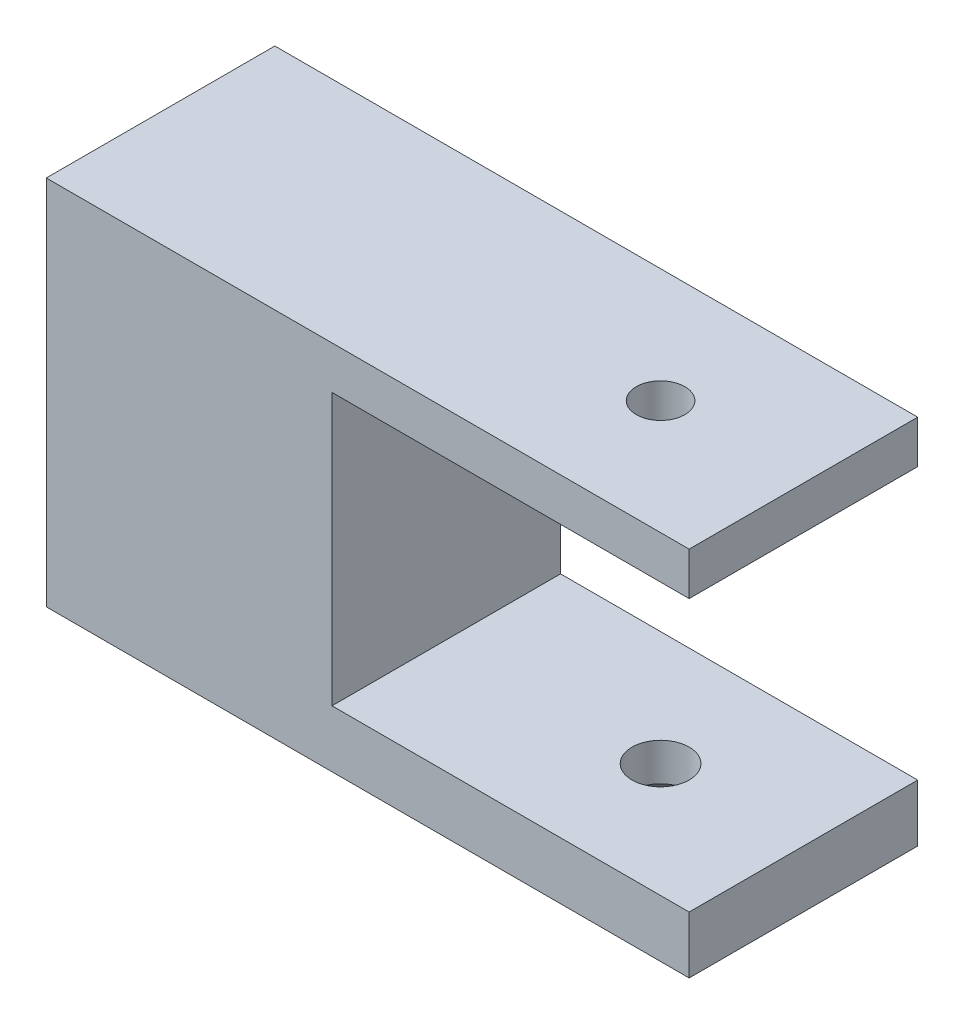
ISO-10303-21;
HEADER;
FILE_DESCRIPTION(('STEP AP214'),'2;1');
FILE_NAME('part.step','',(''),(''),'','','');
FILE_SCHEMA(('AUTOMOTIVE_DESIGN { 1 0 10303 214 1 1 1 1 }'));
ENDSEC;
DATA;
#1=APPLICATION_CONTEXT('core data for automotive mechanical design processes');
#2=APPLICATION_PROTOCOL_DEFINITION('international standard','automotive_design',2000,#1);
#3=PRODUCT_CONTEXT('',#1,'mechanical');
#4=PRODUCT('Part','Part','',(#3));
#5=PRODUCT_RELATED_PRODUCT_CATEGORY('part','',(#4));
#6=PRODUCT_DEFINITION_FORMATION('','',#4);
#7=PRODUCT_DEFINITION_CONTEXT('part definition',#1,'design');
#8=PRODUCT_DEFINITION('design','',#6,#7);
#9=PRODUCT_DEFINITION_SHAPE('','',#8);
#10=(LENGTH_UNIT() NAMED_UNIT(*) SI_UNIT(.MILLI.,.METRE.));
#11=(NAMED_UNIT(*) PLANE_ANGLE_UNIT() SI_UNIT($,.RADIAN.));
#12=(NAMED_UNIT(*) SI_UNIT($,.STERADIAN.) SOLID_ANGLE_UNIT());
#13=UNCERTAINTY_MEASURE_WITH_UNIT(LENGTH_MEASURE(1.E-05),#10,'distance_accuracy_value','');
#14=(GEOMETRIC_REPRESENTATION_CONTEXT(3) GLOBAL_UNCERTAINTY_ASSIGNED_CONTEXT((#13)) GLOBAL_UNIT_ASSIGNED_CONTEXT((#10,
#11,#12)) REPRESENTATION_CONTEXT('',''));
#15=CARTESIAN_POINT('',(0.,0.,0.));
#16=DIRECTION('',(0.,0.,1.));
#17=DIRECTION('',(1.,0.,0.));
#18=AXIS2_PLACEMENT_3D('',#15,#16,#17);
#19=CARTESIAN_POINT('',(-121.785392745691,32.4399830220713,16.));
#20=DIRECTION('',(-1.,0.,0.));
#21=DIRECTION('',(0.,0.,1.));
#22=AXIS2_PLACEMENT_3D('',#19,#20,#21);
#23=PLANE('',#22);
#24=DIRECTION('',(0.,1.,0.));
#25=VECTOR('',#24,1.);
#26=CARTESIAN_POINT('',(-121.785392745691,32.4399830220713,0.));
#27=LINE('',#26,#25);
#28=CARTESIAN_POINT('',(-121.785392745691,29.4399830220713,0.));
#29=VERTEX_POINT('',#28);
#30=CARTESIAN_POINT('',(-121.785392745691,32.4399830220713,0.));
#31=VERTEX_POINT('',#30);
#32=EDGE_CURVE('E140',#29,#31,#27,.T.);
#33=ORIENTED_EDGE('',*,*,#32,.T.);
#34=DIRECTION('',(0.,0.,-1.));
#35=VECTOR('',#34,1.);
#36=CARTESIAN_POINT('',(-121.785392745691,32.4399830220713,16.));
#37=LINE('',#36,#35);
#38=CARTESIAN_POINT('',(-121.785392745691,32.4399830220713,16.));
#39=VERTEX_POINT('',#38);
#40=EDGE_CURVE('E169',#39,#31,#37,.T.);
#41=ORIENTED_EDGE('',*,*,#40,.F.);
#42=DIRECTION('',(0.,1.,0.));
#43=VECTOR('',#42,1.);
#44=CARTESIAN_POINT('',(-121.785392745691,32.4399830220713,16.));
#45=LINE('',#44,#43);
#46=CARTESIAN_POINT('',(-121.785392745691,29.4399830220713,16.));
#47=VERTEX_POINT('',#46);
#48=EDGE_CURVE('E156',#47,#39,#45,.T.);
#49=ORIENTED_EDGE('',*,*,#48,.F.);
#50=DIRECTION('',(0.,0.,-1.));
#51=VECTOR('',#50,1.);
#52=CARTESIAN_POINT('',(-121.785392745691,29.4399830220713,16.));
#53=LINE('',#52,#51);
#54=EDGE_CURVE('E136',#47,#29,#53,.T.);
#55=ORIENTED_EDGE('',*,*,#54,.T.);
#56=EDGE_LOOP('',(#33,#41,#49,#55));
#57=FACE_BOUND('',#56,.T.);
#58=ADVANCED_FACE('F33',(#57),#23,.F.);
#59=CARTESIAN_POINT('',(-166.785392745691,32.4399830220713,16.));
#60=DIRECTION('',(0.,-1.,0.));
#61=DIRECTION('',(0.,0.,-1.));
#62=AXIS2_PLACEMENT_3D('',#59,#60,#61);
#63=PLANE('',#62);
#64=CARTESIAN_POINT('',(-131.785392745691,32.4399830220713,8.));
#65=DIRECTION('',(0.,-1.,0.));
#66=DIRECTION('',(0.,0.,-1.));
#67=AXIS2_PLACEMENT_3D('',#64,#65,#66);
#68=CIRCLE('',#67,1.70000000000001);
#69=CARTESIAN_POINT('',(-131.785392745691,32.4399830220713,6.29999999999999));
#70=VERTEX_POINT('',#69);
#71=EDGE_CURVE('E176',#70,#70,#68,.T.);
#72=ORIENTED_EDGE('',*,*,#71,.T.);
#73=EDGE_LOOP('',(#72));
#74=FACE_BOUND('',#73,.T.);
#75=DIRECTION('',(-1.,0.,0.));
#76=VECTOR('',#75,1.);
#77=CARTESIAN_POINT('',(-166.785392745691,32.4399830220713,0.));
#78=LINE('',#77,#76);
#79=CARTESIAN_POINT('',(-166.785392745691,32.4399830220713,0.));
#80=VERTEX_POINT('',#79);
#81=EDGE_CURVE('E143',#31,#80,#78,.T.);
#82=ORIENTED_EDGE('',*,*,#81,.T.);
#83=DIRECTION('',(0.,0.,-1.));
#84=VECTOR('',#83,1.);
#85=CARTESIAN_POINT('',(-166.785392745691,32.4399830220713,16.));
#86=LINE('',#85,#84);
#87=CARTESIAN_POINT('',(-166.785392745691,32.4399830220713,16.));
#88=VERTEX_POINT('',#87);
#89=EDGE_CURVE('E166',#88,#80,#86,.T.);
#90=ORIENTED_EDGE('',*,*,#89,.F.);
#91=DIRECTION('',(-1.,0.,0.));
#92=VECTOR('',#91,1.);
#93=CARTESIAN_POINT('',(-121.785392745691,32.4399830220713,16.));
#94=LINE('',#93,#92);
#95=EDGE_CURVE('E97',#39,#88,#94,.T.);
#96=ORIENTED_EDGE('',*,*,#95,.F.);
#97=ORIENTED_EDGE('',*,*,#40,.T.);
#98=EDGE_LOOP('',(#82,#90,#96,#97));
#99=FACE_BOUND('',#98,.T.);
#100=ADVANCED_FACE('F231',(#74,#99),#63,.F.);
#101=CARTESIAN_POINT('',(-166.785392745691,6.43998302207129,16.));
#102=DIRECTION('',(1.,0.,0.));
#103=DIRECTION('',(0.,0.,-1.));
#104=AXIS2_PLACEMENT_3D('',#101,#102,#103);
#105=PLANE('',#104);
#106=CARTESIAN_POINT('',(-166.785392745691,19.4399830220713,8.));
#107=DIRECTION('',(-1.,0.,0.));
#108=DIRECTION('',(0.,0.,1.));
#109=AXIS2_PLACEMENT_3D('',#106,#107,#108);
#110=CIRCLE('',#109,6.2);
#111=CARTESIAN_POINT('',(-166.785392745691,19.4399830220713,14.2));
#112=VERTEX_POINT('',#111);
#113=EDGE_CURVE('E202',#112,#112,#110,.T.);
#114=ORIENTED_EDGE('',*,*,#113,.F.);
#115=EDGE_LOOP('',(#114));
#116=FACE_BOUND('',#115,.T.);
#117=DIRECTION('',(0.,-1.,0.));
#118=VECTOR('',#117,1.);
#119=CARTESIAN_POINT('',(-166.785392745691,6.43998302207129,0.));
#120=LINE('',#119,#118);
#121=CARTESIAN_POINT('',(-166.785392745691,6.43998302207129,0.));
#122=VERTEX_POINT('',#121);
#123=EDGE_CURVE('E146',#80,#122,#120,.T.);
#124=ORIENTED_EDGE('',*,*,#123,.T.);
#125=DIRECTION('',(0.,0.,-1.));
#126=VECTOR('',#125,1.);
#127=CARTESIAN_POINT('',(-166.785392745691,6.43998302207129,16.));
#128=LINE('',#127,#126);
#129=CARTESIAN_POINT('',(-166.785392745691,6.43998302207129,16.));
#130=VERTEX_POINT('',#129);
#131=EDGE_CURVE('E163',#130,#122,#128,.T.);
#132=ORIENTED_EDGE('',*,*,#131,.F.);
#133=DIRECTION('',(0.,-1.,0.));
#134=VECTOR('',#133,1.);
#135=CARTESIAN_POINT('',(-166.785392745691,6.43998302207129,16.));
#136=LINE('',#135,#134);
#137=EDGE_CURVE('E211',#88,#130,#136,.T.);
#138=ORIENTED_EDGE('',*,*,#137,.F.);
#139=ORIENTED_EDGE('',*,*,#89,.T.);
#140=EDGE_LOOP('',(#124,#132,#138,#139));
#141=FACE_BOUND('',#140,.T.);
#142=ADVANCED_FACE('F234',(#116,#141),#105,.F.);
#143=CARTESIAN_POINT('',(-121.785392745691,6.4399830220713,16.));
#144=DIRECTION('',(0.,1.,0.));
#145=DIRECTION('',(-1.,0.,0.));
#146=AXIS2_PLACEMENT_3D('',#143,#144,#145);
#147=PLANE('',#146);
#148=CARTESIAN_POINT('',(-131.785392745691,6.43998302207129,8.));
#149=DIRECTION('',(0.,-1.,0.));
#150=DIRECTION('',(0.,0.,-1.));
#151=AXIS2_PLACEMENT_3D('',#148,#149,#150);
#152=CIRCLE('',#151,3.36);
#153=CARTESIAN_POINT('',(-131.785392745691,6.43998302207129,4.64));
#154=VERTEX_POINT('',#153);
#155=EDGE_CURVE('E200',#154,#154,#152,.T.);
#156=ORIENTED_EDGE('',*,*,#155,.F.);
#157=EDGE_LOOP('',(#156));
#158=FACE_BOUND('',#157,.T.);
#159=DIRECTION('',(1.,0.,0.));
#160=VECTOR('',#159,1.);
#161=CARTESIAN_POINT('',(-121.785392745691,6.4399830220713,0.));
#162=LINE('',#161,#160);
#163=CARTESIAN_POINT('',(-121.785392745691,6.4399830220713,0.));
#164=VERTEX_POINT('',#163);
#165=EDGE_CURVE('E148',#122,#164,#162,.T.);
#166=ORIENTED_EDGE('',*,*,#165,.T.);
#167=DIRECTION('',(0.,0.,-1.));
#168=VECTOR('',#167,1.);
#169=CARTESIAN_POINT('',(-121.785392745691,6.4399830220713,16.));
#170=LINE('',#169,#168);
#171=CARTESIAN_POINT('',(-121.785392745691,6.4399830220713,16.));
#172=VERTEX_POINT('',#171);
#173=EDGE_CURVE('E160',#172,#164,#170,.T.);
#174=ORIENTED_EDGE('',*,*,#173,.F.);
#175=DIRECTION('',(1.,0.,0.));
#176=VECTOR('',#175,1.);
#177=CARTESIAN_POINT('',(-121.785392745691,6.4399830220713,16.));
#178=LINE('',#177,#176);
#179=EDGE_CURVE('E213',#130,#172,#178,.T.);
#180=ORIENTED_EDGE('',*,*,#179,.F.);
#181=ORIENTED_EDGE('',*,*,#131,.T.);
#182=EDGE_LOOP('',(#166,#174,#180,#181));
#183=FACE_BOUND('',#182,.T.);
#184=ADVANCED_FACE('F219',(#158,#183),#147,.F.);
#185=CARTESIAN_POINT('',(-121.785392745691,10.4399830220713,16.));
#186=DIRECTION('',(-1.,0.,0.));
#187=DIRECTION('',(0.,0.,1.));
#188=AXIS2_PLACEMENT_3D('',#185,#186,#187);
#189=PLANE('',#188);
#190=DIRECTION('',(0.,1.,0.));
#191=VECTOR('',#190,1.);
#192=CARTESIAN_POINT('',(-121.785392745691,10.4399830220713,0.));
#193=LINE('',#192,#191);
#194=CARTESIAN_POINT('',(-121.785392745691,10.4399830220713,0.));
#195=VERTEX_POINT('',#194);
#196=EDGE_CURVE('E150',#164,#195,#193,.T.);
#197=ORIENTED_EDGE('',*,*,#196,.T.);
#198=DIRECTION('',(0.,0.,-1.));
#199=VECTOR('',#198,1.);
#200=CARTESIAN_POINT('',(-121.785392745691,10.4399830220713,16.));
#201=LINE('',#200,#199);
#202=CARTESIAN_POINT('',(-121.785392745691,10.4399830220713,16.));
#203=VERTEX_POINT('',#202);
#204=EDGE_CURVE('E131',#203,#195,#201,.T.);
#205=ORIENTED_EDGE('',*,*,#204,.F.);
#206=DIRECTION('',(0.,1.,0.));
#207=VECTOR('',#206,1.);
#208=CARTESIAN_POINT('',(-121.785392745691,10.4399830220713,16.));
#209=LINE('',#208,#207);
#210=EDGE_CURVE('E119',#172,#203,#209,.T.);
#211=ORIENTED_EDGE('',*,*,#210,.F.);
#212=ORIENTED_EDGE('',*,*,#173,.T.);
#213=EDGE_LOOP('',(#197,#205,#211,#212));
#214=FACE_BOUND('',#213,.T.);
#215=ADVANCED_FACE('F223',(#214),#189,.F.);
#216=CARTESIAN_POINT('',(-146.785392745691,10.4399830220713,16.));
#217=DIRECTION('',(0.,-1.,0.));
#218=DIRECTION('',(0.,0.,-1.));
#219=AXIS2_PLACEMENT_3D('',#216,#217,#218);
#220=PLANE('',#219);
#221=CARTESIAN_POINT('',(-131.785392745691,10.4399830220713,8.));
#222=DIRECTION('',(0.,-1.,0.));
#223=DIRECTION('',(1.,0.,0.));
#224=AXIS2_PLACEMENT_3D('',#221,#222,#223);
#225=CIRCLE('',#224,2.);
#226=CARTESIAN_POINT('',(-129.785392745691,10.4399830220713,8.));
#227=VERTEX_POINT('',#226);
#228=EDGE_CURVE('E179',#227,#227,#225,.T.);
#229=ORIENTED_EDGE('',*,*,#228,.T.);
#230=EDGE_LOOP('',(#229));
#231=FACE_BOUND('',#230,.T.);
#232=DIRECTION('',(-1.,0.,0.));
#233=VECTOR('',#232,1.);
#234=CARTESIAN_POINT('',(-146.785392745691,10.4399830220713,0.));
#235=LINE('',#234,#233);
#236=CARTESIAN_POINT('',(-146.785392745691,10.4399830220713,0.));
#237=VERTEX_POINT('',#236);
#238=EDGE_CURVE('E128',#195,#237,#235,.T.);
#239=ORIENTED_EDGE('',*,*,#238,.T.);
#240=DIRECTION('',(0.,0.,-1.));
#241=VECTOR('',#240,1.);
#242=CARTESIAN_POINT('',(-146.785392745691,10.4399830220713,16.));
#243=LINE('',#242,#241);
#244=CARTESIAN_POINT('',(-146.785392745691,10.4399830220713,16.));
#245=VERTEX_POINT('',#244);
#246=EDGE_CURVE('E125',#245,#237,#243,.T.);
#247=ORIENTED_EDGE('',*,*,#246,.F.);
#248=DIRECTION('',(-1.,0.,0.));
#249=VECTOR('',#248,1.);
#250=CARTESIAN_POINT('',(-146.785392745691,10.4399830220713,16.));
#251=LINE('',#250,#249);
#252=EDGE_CURVE('E112',#203,#245,#251,.T.);
#253=ORIENTED_EDGE('',*,*,#252,.F.);
#254=ORIENTED_EDGE('',*,*,#204,.T.);
#255=EDGE_LOOP('',(#239,#247,#253,#254));
#256=FACE_BOUND('',#255,.T.);
#257=ADVANCED_FACE('F126',(#231,#256),#220,.F.);
#258=CARTESIAN_POINT('',(-146.785392745691,29.4399830220713,16.));
#259=DIRECTION('',(-1.,0.,0.));
#260=DIRECTION('',(0.,0.,1.));
#261=AXIS2_PLACEMENT_3D('',#258,#259,#260);
#262=PLANE('',#261);
#263=DIRECTION('',(0.,1.,0.));
#264=VECTOR('',#263,1.);
#265=CARTESIAN_POINT('',(-146.785392745691,29.4399830220713,0.));
#266=LINE('',#265,#264);
#267=CARTESIAN_POINT('',(-146.785392745691,29.4399830220713,0.));
#268=VERTEX_POINT('',#267);
#269=EDGE_CURVE('E153',#237,#268,#266,.T.);
#270=ORIENTED_EDGE('',*,*,#269,.T.);
#271=DIRECTION('',(0.,0.,-1.));
#272=VECTOR('',#271,1.);
#273=CARTESIAN_POINT('',(-146.785392745691,29.4399830220713,16.));
#274=LINE('',#273,#272);
#275=CARTESIAN_POINT('',(-146.785392745691,29.4399830220713,16.));
#276=VERTEX_POINT('',#275);
#277=EDGE_CURVE('E132',#276,#268,#274,.T.);
#278=ORIENTED_EDGE('',*,*,#277,.F.);
#279=DIRECTION('',(0.,1.,0.));
#280=VECTOR('',#279,1.);
#281=CARTESIAN_POINT('',(-146.785392745691,29.4399830220713,16.));
#282=LINE('',#281,#280);
#283=EDGE_CURVE('E116',#245,#276,#282,.T.);
#284=ORIENTED_EDGE('',*,*,#283,.F.);
#285=ORIENTED_EDGE('',*,*,#246,.T.);
#286=EDGE_LOOP('',(#270,#278,#284,#285));
#287=FACE_BOUND('',#286,.T.);
#288=ADVANCED_FACE('F134',(#287),#262,.F.);
#289=CARTESIAN_POINT('',(-121.785392745691,29.4399830220713,16.));
#290=DIRECTION('',(0.,1.,0.));
#291=DIRECTION('',(0.,0.,1.));
#292=AXIS2_PLACEMENT_3D('',#289,#290,#291);
#293=PLANE('',#292);
#294=CARTESIAN_POINT('',(-131.785392745691,29.4399830220713,8.));
#295=DIRECTION('',(0.,1.,0.));
#296=DIRECTION('',(0.,0.,1.));
#297=AXIS2_PLACEMENT_3D('',#294,#295,#296);
#298=CIRCLE('',#297,1.70000000000001);
#299=CARTESIAN_POINT('',(-131.785392745691,29.4399830220713,9.70000000000001));
#300=VERTEX_POINT('',#299);
#301=EDGE_CURVE('E175',#300,#300,#298,.T.);
#302=ORIENTED_EDGE('',*,*,#301,.T.);
#303=EDGE_LOOP('',(#302));
#304=FACE_BOUND('',#303,.T.);
#305=DIRECTION('',(1.,0.,0.));
#306=VECTOR('',#305,1.);
#307=CARTESIAN_POINT('',(-121.785392745691,29.4399830220713,0.));
#308=LINE('',#307,#306);
#309=EDGE_CURVE('E88',#268,#29,#308,.T.);
#310=ORIENTED_EDGE('',*,*,#309,.T.);
#311=ORIENTED_EDGE('',*,*,#54,.F.);
#312=DIRECTION('',(1.,0.,0.));
#313=VECTOR('',#312,1.);
#314=CARTESIAN_POINT('',(-121.785392745691,29.4399830220713,16.));
#315=LINE('',#314,#313);
#316=EDGE_CURVE('E55',#276,#47,#315,.T.);
#317=ORIENTED_EDGE('',*,*,#316,.F.);
#318=ORIENTED_EDGE('',*,*,#277,.T.);
#319=EDGE_LOOP('',(#310,#311,#317,#318));
#320=FACE_BOUND('',#319,.T.);
#321=ADVANCED_FACE('F227',(#304,#320),#293,.F.);
#322=CARTESIAN_POINT('',(0.,0.,16.));
#323=DIRECTION('',(0.,0.,-1.));
#324=DIRECTION('',(-1.,0.,0.));
#325=AXIS2_PLACEMENT_3D('',#322,#323,#324);
#326=PLANE('',#325);
#327=ORIENTED_EDGE('',*,*,#48,.T.);
#328=ORIENTED_EDGE('',*,*,#95,.T.);
#329=ORIENTED_EDGE('',*,*,#137,.T.);
#330=ORIENTED_EDGE('',*,*,#179,.T.);
#331=ORIENTED_EDGE('',*,*,#210,.T.);
#332=ORIENTED_EDGE('',*,*,#252,.T.);
#333=ORIENTED_EDGE('',*,*,#283,.T.);
#334=ORIENTED_EDGE('',*,*,#316,.T.);
#335=EDGE_LOOP('',(#327,#328,#329,#330,#331,#332,#333,#334));
#336=FACE_BOUND('',#335,.T.);
#337=ADVANCED_FACE('F114',(#336),#326,.F.);
#338=CARTESIAN_POINT('',(0.,0.,0.));
#339=DIRECTION('',(0.,0.,-1.));
#340=DIRECTION('',(-1.,0.,0.));
#341=AXIS2_PLACEMENT_3D('',#338,#339,#340);
#342=PLANE('',#341);
#343=CARTESIAN_POINT('',(-152.785392745691,19.4399830220713,0.));
#344=DIRECTION('',(0.,0.,-1.));
#345=DIRECTION('',(-1.,0.,0.));
#346=AXIS2_PLACEMENT_3D('',#343,#344,#345);
#347=CIRCLE('',#346,3.49999999999999);
#348=CARTESIAN_POINT('',(-156.285392745691,19.4399830220713,0.));
#349=VERTEX_POINT('',#348);
#350=EDGE_CURVE('E362',#349,#349,#347,.T.);
#351=ORIENTED_EDGE('',*,*,#350,.F.);
#352=EDGE_LOOP('',(#351));
#353=FACE_BOUND('',#352,.T.);
#354=ORIENTED_EDGE('',*,*,#32,.F.);
#355=ORIENTED_EDGE('',*,*,#309,.F.);
#356=ORIENTED_EDGE('',*,*,#269,.F.);
#357=ORIENTED_EDGE('',*,*,#238,.F.);
#358=ORIENTED_EDGE('',*,*,#196,.F.);
#359=ORIENTED_EDGE('',*,*,#165,.F.);
#360=ORIENTED_EDGE('',*,*,#123,.F.);
#361=ORIENTED_EDGE('',*,*,#81,.F.);
#362=EDGE_LOOP('',(#354,#355,#356,#357,#358,#359,#360,#361));
#363=FACE_BOUND('',#362,.T.);
#364=ADVANCED_FACE('F226',(#353,#363),#342,.T.);
#365=CARTESIAN_POINT('',(-149.785392745691,19.4399830220713,8.));
#366=DIRECTION('',(-1.,0.,0.));
#367=DIRECTION('',(0.,0.,1.));
#368=AXIS2_PLACEMENT_3D('',#365,#366,#367);
#369=CYLINDRICAL_SURFACE('',#368,6.2);
#370=CARTESIAN_POINT('',(-149.785392745691,19.4399830220713,8.));
#371=DIRECTION('',(-1.,0.,0.));
#372=DIRECTION('',(0.,0.,1.));
#373=AXIS2_PLACEMENT_3D('',#370,#371,#372);
#374=CIRCLE('',#373,6.2);
#375=CARTESIAN_POINT('',(-149.785392745691,17.6372073843393,2.06788402001445));
#376=VERTEX_POINT('',#375);
#377=CARTESIAN_POINT('',(-149.785392745691,21.2427586598033,2.06788402001445));
#378=VERTEX_POINT('',#377);
#379=EDGE_CURVE('E144',#376,#378,#374,.T.);
#380=ORIENTED_EDGE('',*,*,#379,.F.);
#381=CARTESIAN_POINT('',(-149.785392745691,17.6372073843393,2.06788402001445));
#382=CARTESIAN_POINT('',(-149.8381893203,17.5493510485773,2.09457418184887));
#383=CARTESIAN_POINT('',(-149.894646073654,17.4641401788941,2.12261103992937));
#384=CARTESIAN_POINT('',(-150.014413358026,17.2994126175649,2.18058845752548));
#385=CARTESIAN_POINT('',(-150.077721570529,17.2198940147117,2.21052837164569));
#386=CARTESIAN_POINT('',(-150.211004163949,17.0666152861882,2.27165259515535));
#387=CARTESIAN_POINT('',(-150.281002028159,16.9928772334427,2.30284104691949));
#388=CARTESIAN_POINT('',(-150.427050340892,16.8518304675497,2.36551417310408));
#389=CARTESIAN_POINT('',(-150.503101339181,16.7845223396126,2.39699887420132));
#390=CARTESIAN_POINT('',(-150.739743223298,16.5927901105561,2.49058506639717));
#391=CARTESIAN_POINT('',(-150.908982655501,16.478374910113,2.55189512708249));
#392=CARTESIAN_POINT('',(-151.267048898071,16.279855590331,2.66458255219965));
#393=CARTESIAN_POINT('',(-151.45583485487,16.1956898314485,2.71598001537695));
#394=CARTESIAN_POINT('',(-151.809603865211,16.0746538574353,2.79244540699385));
#395=CARTESIAN_POINT('',(-151.971798919014,16.0316919175508,2.82072302471799));
#396=CARTESIAN_POINT('',(-152.302490208652,15.9693863315022,2.86225693002618));
#397=CARTESIAN_POINT('',(-152.470979987917,15.9500191341795,2.87552819529048));
#398=CARTESIAN_POINT('',(-152.809884778442,15.935953337043,2.885133253635));
#399=CARTESIAN_POINT('',(-152.98030335809,15.9413122618532,2.88142755041995));
#400=CARTESIAN_POINT('',(-153.317443701441,15.9765041924066,2.85755529453705));
#401=CARTESIAN_POINT('',(-153.484163376448,16.0063506818111,2.83737967301923));
#402=CARTESIAN_POINT('',(-153.805167777946,16.0878495320962,2.78411435617786));
#403=CARTESIAN_POINT('',(-153.959663046587,16.1389151608516,2.75137382831322));
#404=CARTESIAN_POINT('',(-154.258188768705,16.2608471904667,2.67663676068058));
#405=CARTESIAN_POINT('',(-154.40221541681,16.3317207466519,2.63463687726515));
#406=CARTESIAN_POINT('',(-154.698035105063,16.5031307888828,2.53869427246756));
#407=CARTESIAN_POINT('',(-154.847924486569,16.6064787184149,2.48390289855704));
#408=CARTESIAN_POINT('',(-155.129623135847,16.834696318073,2.37250914807443));
#409=CARTESIAN_POINT('',(-155.261417151754,16.9595839455684,2.31590529278374));
#410=CARTESIAN_POINT('',(-155.520239895299,17.2462700465356,2.19875665867357));
#411=CARTESIAN_POINT('',(-155.644548628499,17.4107403937311,2.13862137229826));
#412=CARTESIAN_POINT('',(-155.808716484433,17.6735673576016,2.056240969624));
#413=CARTESIAN_POINT('',(-155.859742330176,17.7639104194408,2.03007392756657));
#414=CARTESIAN_POINT('',(-155.953861674428,17.9494774980673,1.98106528431758));
#415=CARTESIAN_POINT('',(-155.996959731158,18.0446986695769,1.9582217737929));
#416=CARTESIAN_POINT('',(-156.072760086108,18.2345214273789,1.91758157191007));
#417=CARTESIAN_POINT('',(-156.105873467622,18.3289173396188,1.89959008397183));
#418=CARTESIAN_POINT('',(-156.164023241543,18.5208002225276,1.86774499339738));
#419=CARTESIAN_POINT('',(-156.189063931356,18.6182855181402,1.85388918946929));
#420=CARTESIAN_POINT('',(-156.230706606808,18.8155118494187,1.83073033752543));
#421=CARTESIAN_POINT('',(-156.24731394549,18.9152514120899,1.82142440163556));
#422=CARTESIAN_POINT('',(-156.271844496167,19.1161197081927,1.80764650405669));
#423=CARTESIAN_POINT('',(-156.279768798084,19.2172482656592,1.80317393566882));
#424=CARTESIAN_POINT('',(-156.286370356153,19.4074097120222,1.79944843131047));
#425=CARTESIAN_POINT('',(-156.286066575144,19.4963978271631,1.79962032022083));
#426=CARTESIAN_POINT('',(-156.278689916928,19.6740327451719,1.80378214826332));
#427=CARTESIAN_POINT('',(-156.271614912755,19.762679432006,1.807773287092));
#428=CARTESIAN_POINT('',(-156.250785791092,19.9388984075605,1.81947624811055));
#429=CARTESIAN_POINT('',(-156.237034583841,20.0264711473899,1.82718644910615));
#430=CARTESIAN_POINT('',(-156.203031091044,20.1999679825014,1.84613475069187));
#431=CARTESIAN_POINT('',(-156.182776309474,20.285891431358,1.85737420574707));
#432=CARTESIAN_POINT('',(-156.113755860515,20.5360434087231,1.89536937722083));
#433=CARTESIAN_POINT('',(-156.05617013753,20.6972408615994,1.92673051437327));
#434=CARTESIAN_POINT('',(-155.919309933033,21.0075946275004,1.99932594336065));
#435=CARTESIAN_POINT('',(-155.840030850537,21.1567483774535,2.04056232942311));
#436=CARTESIAN_POINT('',(-155.653646091438,21.4541161590576,2.13401640727023));
#437=CARTESIAN_POINT('',(-155.544622465379,21.6009177307525,2.18690266564541));
#438=CARTESIAN_POINT('',(-155.305883453015,21.875193689761,2.29635092721798));
#439=CARTESIAN_POINT('',(-155.176146474256,22.0026476348225,2.3529167292548));
#440=CARTESIAN_POINT('',(-154.8821723614,22.249699902315,2.4713177865065));
#441=CARTESIAN_POINT('',(-154.71568274248,22.3667033304913,2.53300971266139));
#442=CARTESIAN_POINT('',(-154.362641460224,22.5710818235009,2.64743264506014));
#443=CARTESIAN_POINT('',(-154.176109719801,22.6584859591354,2.70017241807023));
#444=CARTESIAN_POINT('',(-153.824599485556,22.7863159888787,2.78017088194965));
#445=CARTESIAN_POINT('',(-153.66241316411,22.832553970885,2.81038330624612));
#446=CARTESIAN_POINT('',(-153.331129913734,22.9012986354667,2.85597073061453));
#447=CARTESIAN_POINT('',(-153.162041324994,22.9238331265185,2.87136311546976));
#448=CARTESIAN_POINT('',(-152.821161210513,22.9439732402196,2.88509805526773));
#449=CARTESIAN_POINT('',(-152.649363194556,22.9415053021562,2.88339029932846));
#450=CARTESIAN_POINT('',(-152.308953401395,22.9116151123764,2.86306796604682));
#451=CARTESIAN_POINT('',(-152.140343036551,22.884182052111,2.84444606580052));
#452=CARTESIAN_POINT('',(-151.817091152689,22.8073280796071,2.79394818423317));
#453=CARTESIAN_POINT('',(-151.662164185099,22.7587494483769,2.76258272098713));
#454=CARTESIAN_POINT('',(-151.362399886347,22.6417040405417,2.69022601842818));
#455=CARTESIAN_POINT('',(-151.217569163926,22.5732243860242,2.64922854956477));
#456=CARTESIAN_POINT('',(-150.920568696786,22.4073502104409,2.55527586416732));
#457=CARTESIAN_POINT('',(-150.770185766964,22.3072570265905,2.50145048831189));
#458=CARTESIAN_POINT('',(-150.487094476263,22.0857546815752,2.39150996281129));
#459=CARTESIAN_POINT('',(-150.354379607218,21.9643534078253,2.3353956663136));
#460=CARTESIAN_POINT('',(-150.14738640067,21.7434736147761,2.24296875536751));
#461=CARTESIAN_POINT('',(-150.067868410135,21.6491337818365,2.20598607123998));
#462=CARTESIAN_POINT('',(-149.918920449132,21.4520858298735,2.13463923561153));
#463=CARTESIAN_POINT('',(-149.849478842116,21.3493875809445,2.10027208577779));
#464=CARTESIAN_POINT('',(-149.785392745691,21.2427586598033,2.06788402001445));
#465=B_SPLINE_CURVE_WITH_KNOTS('',3,(#381,#382,#383,#384,#385,#386,#387,#388,#389,#390,#391,
#392,#393,#394,#395,#396,#397,#398,#399,#400,#401,#402,#403,#404,#405,#406,#407,#408,#409,#410,
#411,#412,#413,#414,#415,#416,#417,#418,#419,#420,#421,#422,#423,#424,#425,#426,#427,#428,#429,
#430,#431,#432,#433,#434,#435,#436,#437,#438,#439,#440,#441,#442,#443,#444,#445,#446,#447,#448,
#449,#450,#451,#452,#453,#454,#455,#456,#457,#458,#459,#460,#461,#462,#463,#464),.UNSPECIFIED.,
.F.,.F.,(4,2,2,2,2,2,2,2,2,2,2,2,2,2,2,2,2,2,2,2,2,2,2,2,2,2,2,2,2,2,2,2,2,2,2,2,2,2,2,2,2,4),
(0.,0.317603465736774,0.635099789433216,0.953754729111194,1.27243864312916,1.90905137001857,
2.54435941078576,3.05264096134539,3.56041475247611,4.06937045983748,4.57860660324638,
5.07461125706697,5.57079531745091,6.13894977864477,6.70758021292551,7.34826443092954,
7.66891402543124,7.98937867658786,8.29387056218432,8.59820008631687,8.9023361960503,
9.20643412526583,9.47306703290313,9.73978372233613,10.0063842509425,10.2730872214123,
10.7927649489082,11.3125529813364,11.8813122378584,12.4506683109834,13.0855909515073,
13.7198881849586,14.2317179331575,14.7429465406072,15.2556796913219,15.7686349334517,
16.2627993961446,16.7572843464305,17.3206326884053,17.8837729391254,18.2695414282796,
18.6548608115409),.UNSPECIFIED.);
#466=EDGE_CURVE('E190',#376,#378,#465,.T.);
#467=ORIENTED_EDGE('',*,*,#466,.T.);
#468=EDGE_LOOP('',(#380,#467));
#469=FACE_BOUND('',#468,.T.);
#470=ORIENTED_EDGE('',*,*,#113,.T.);
#471=EDGE_LOOP('',(#470));
#472=FACE_BOUND('',#471,.T.);
#473=ADVANCED_FACE('F198',(#469,#472),#369,.F.);
#474=CARTESIAN_POINT('',(-149.785392745691,19.4399830220713,8.));
#475=DIRECTION('',(-1.,0.,0.));
#476=DIRECTION('',(0.,0.,1.));
#477=AXIS2_PLACEMENT_3D('',#474,#475,#476);
#478=PLANE('',#477);
#479=DIRECTION('',(0.,0.,-1.));
#480=VECTOR('',#479,1.);
#481=CARTESIAN_POINT('',(-149.785392745691,21.2427586598033,10.));
#482=LINE('',#481,#480);
#483=CARTESIAN_POINT('',(-149.785392745691,21.2427586598033,10.));
#484=VERTEX_POINT('',#483);
#485=EDGE_CURVE('E11',#484,#378,#482,.T.);
#486=ORIENTED_EDGE('',*,*,#485,.F.);
#487=DIRECTION('',(0.,-1.,0.));
#488=VECTOR('',#487,1.);
#489=CARTESIAN_POINT('',(-149.785392745691,19.4399830220713,10.));
#490=LINE('',#489,#488);
#491=CARTESIAN_POINT('',(-149.785392745691,17.6372073843393,10.));
#492=VERTEX_POINT('',#491);
#493=EDGE_CURVE('E171',#484,#492,#490,.T.);
#494=ORIENTED_EDGE('',*,*,#493,.T.);
#495=DIRECTION('',(0.,0.,-1.));
#496=VECTOR('',#495,1.);
#497=CARTESIAN_POINT('',(-149.785392745691,17.6372073843393,10.));
#498=LINE('',#497,#496);
#499=EDGE_CURVE('E40',#376,#492,#498,.F.);
#500=ORIENTED_EDGE('',*,*,#499,.F.);
#501=ORIENTED_EDGE('',*,*,#379,.T.);
#502=EDGE_LOOP('',(#486,#494,#500,#501));
#503=FACE_BOUND('',#502,.T.);
#504=ADVANCED_FACE('F194',(#503),#478,.T.);
#505=CARTESIAN_POINT('',(-131.785392745691,10.4399830220713,8.));
#506=DIRECTION('',(0.,-1.,0.));
#507=DIRECTION('',(1.,0.,0.));
#508=AXIS2_PLACEMENT_3D('',#505,#506,#507);
#509=CYLINDRICAL_SURFACE('',#508,2.);
#510=CARTESIAN_POINT('',(-131.785392745691,7.7999830220713,8.));
#511=DIRECTION('',(0.,-1.,0.));
#512=DIRECTION('',(0.,0.,-1.));
#513=AXIS2_PLACEMENT_3D('',#510,#511,#512);
#514=CIRCLE('',#513,2.);
#515=CARTESIAN_POINT('',(-131.785392745691,7.7999830220713,6.));
#516=VERTEX_POINT('',#515);
#517=EDGE_CURVE('E172',#516,#516,#514,.T.);
#518=ORIENTED_EDGE('',*,*,#517,.T.);
#519=EDGE_LOOP('',(#518));
#520=FACE_BOUND('',#519,.T.);
#521=ORIENTED_EDGE('',*,*,#228,.F.);
#522=EDGE_LOOP('',(#521));
#523=FACE_BOUND('',#522,.T.);
#524=ADVANCED_FACE('F286',(#520,#523),#509,.F.);
#525=CARTESIAN_POINT('',(-131.785392745691,6.43998302207129,8.));
#526=DIRECTION('',(0.,-1.,0.));
#527=DIRECTION('',(0.,0.,-1.));
#528=AXIS2_PLACEMENT_3D('',#525,#526,#527);
#529=CONICAL_SURFACE('',#528,3.36,0.785398163397447);
#530=ORIENTED_EDGE('',*,*,#155,.T.);
#531=EDGE_LOOP('',(#530));
#532=FACE_BOUND('',#531,.T.);
#533=ORIENTED_EDGE('',*,*,#517,.F.);
#534=EDGE_LOOP('',(#533));
#535=FACE_BOUND('',#534,.T.);
#536=ADVANCED_FACE('F291',(#532,#535),#529,.F.);
#537=CARTESIAN_POINT('',(-131.785392745691,6.43998302207129,8.));
#538=DIRECTION('',(0.,-1.,0.));
#539=DIRECTION('',(0.,0.,-1.));
#540=AXIS2_PLACEMENT_3D('',#537,#538,#539);
#541=CYLINDRICAL_SURFACE('',#540,1.70000000000001);
#542=ORIENTED_EDGE('',*,*,#71,.F.);
#543=EDGE_LOOP('',(#542));
#544=FACE_BOUND('',#543,.T.);
#545=ORIENTED_EDGE('',*,*,#301,.F.);
#546=EDGE_LOOP('',(#545));
#547=FACE_BOUND('',#546,.T.);
#548=ADVANCED_FACE('F303',(#544,#547),#541,.F.);
#549=CARTESIAN_POINT('',(-152.785392745691,19.4399830220713,10.));
#550=DIRECTION('',(0.,0.,-1.));
#551=DIRECTION('',(-1.,0.,0.));
#552=AXIS2_PLACEMENT_3D('',#549,#550,#551);
#553=CYLINDRICAL_SURFACE('',#552,3.49999999999999);
#554=ORIENTED_EDGE('',*,*,#485,.T.);
#555=ORIENTED_EDGE('',*,*,#466,.F.);
#556=ORIENTED_EDGE('',*,*,#499,.T.);
#557=CARTESIAN_POINT('',(-152.785392745691,19.4399830220713,10.));
#558=DIRECTION('',(0.,0.,-1.));
#559=DIRECTION('',(-1.,0.,0.));
#560=AXIS2_PLACEMENT_3D('',#557,#558,#559);
#561=CIRCLE('',#560,3.49999999999999);
#562=EDGE_CURVE('E46',#484,#492,#561,.T.);
#563=ORIENTED_EDGE('',*,*,#562,.F.);
#564=EDGE_LOOP('',(#554,#555,#556,#563));
#565=FACE_BOUND('',#564,.T.);
#566=ORIENTED_EDGE('',*,*,#350,.T.);
#567=EDGE_LOOP('',(#566));
#568=FACE_BOUND('',#567,.T.);
#569=ADVANCED_FACE('F184',(#565,#568),#553,.F.);
#570=CARTESIAN_POINT('',(-152.785392745691,19.4399830220713,10.));
#571=DIRECTION('',(0.,0.,-1.));
#572=DIRECTION('',(-1.,0.,0.));
#573=AXIS2_PLACEMENT_3D('',#570,#571,#572);
#574=PLANE('',#573);
#575=ORIENTED_EDGE('',*,*,#562,.T.);
#576=ORIENTED_EDGE('',*,*,#493,.F.);
#577=EDGE_LOOP('',(#575,#576));
#578=FACE_BOUND('',#577,.T.);
#579=ADVANCED_FACE('F195',(#578),#574,.T.);
#580=CLOSED_SHELL('',(#58,#100,#142,#184,#215,#257,#288,#321,#337,#364,#473,#504,#524,#536,#548,
#569,#579));
#581=MANIFOLD_SOLID_BREP('B2',#580);
#582=ADVANCED_BREP_SHAPE_REPRESENTATION('',(#18,#581),#14);
#583=SHAPE_DEFINITION_REPRESENTATION(#9,#582);
ENDSEC;
END-ISO-10303-21;
